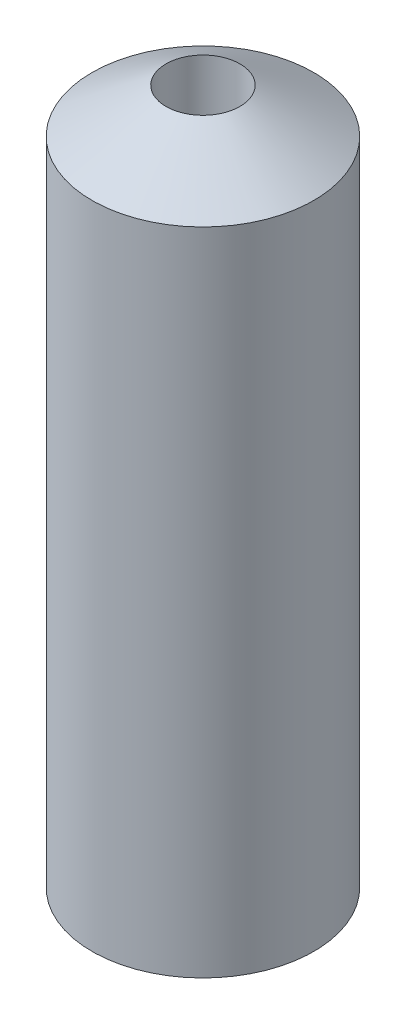
ISO-10303-21;
HEADER;
FILE_DESCRIPTION(('STEP AP214'),'2;1');
FILE_NAME('part.step','',(''),(''),'','','');
FILE_SCHEMA(('AUTOMOTIVE_DESIGN { 1 0 10303 214 1 1 1 1 }'));
ENDSEC;
DATA;
#1=APPLICATION_CONTEXT('core data for automotive mechanical design processes');
#2=APPLICATION_PROTOCOL_DEFINITION('international standard','automotive_design',2000,#1);
#3=PRODUCT_CONTEXT('',#1,'mechanical');
#4=PRODUCT('Part','Part','',(#3));
#5=PRODUCT_RELATED_PRODUCT_CATEGORY('part','',(#4));
#6=PRODUCT_DEFINITION_FORMATION('','',#4);
#7=PRODUCT_DEFINITION_CONTEXT('part definition',#1,'design');
#8=PRODUCT_DEFINITION('design','',#6,#7);
#9=PRODUCT_DEFINITION_SHAPE('','',#8);
#10=(LENGTH_UNIT() NAMED_UNIT(*) SI_UNIT(.MILLI.,.METRE.));
#11=(NAMED_UNIT(*) PLANE_ANGLE_UNIT() SI_UNIT($,.RADIAN.));
#12=(NAMED_UNIT(*) SI_UNIT($,.STERADIAN.) SOLID_ANGLE_UNIT());
#13=UNCERTAINTY_MEASURE_WITH_UNIT(LENGTH_MEASURE(1.E-05),#10,'distance_accuracy_value','');
#14=(GEOMETRIC_REPRESENTATION_CONTEXT(3) GLOBAL_UNCERTAINTY_ASSIGNED_CONTEXT((#13)) GLOBAL_UNIT_ASSIGNED_CONTEXT((#10,
#11,#12)) REPRESENTATION_CONTEXT('',''));
#15=CARTESIAN_POINT('',(0.,0.,0.));
#16=DIRECTION('',(0.,0.,1.));
#17=DIRECTION('',(1.,0.,0.));
#18=AXIS2_PLACEMENT_3D('',#15,#16,#17);
#19=CARTESIAN_POINT('',(0.,9.39913938097244,0.));
#20=DIRECTION('',(0.,-1.,0.));
#21=DIRECTION('',(1.,0.,0.));
#22=AXIS2_PLACEMENT_3D('',#19,#20,#21);
#23=CONICAL_SURFACE('',#22,1.5,1.02974425867665);
#24=CARTESIAN_POINT('',(0.,10.,0.));
#25=DIRECTION('',(0.,1.,0.));
#26=DIRECTION('',(-1.,0.,0.));
#27=AXIS2_PLACEMENT_3D('',#24,#25,#26);
#28=CIRCLE('',#27,0.5);
#29=CARTESIAN_POINT('',(-0.5,10.,0.));
#30=VERTEX_POINT('',#29);
#31=EDGE_CURVE('E62',#30,#30,#28,.T.);
#32=ORIENTED_EDGE('',*,*,#31,.F.);
#33=EDGE_LOOP('',(#32));
#34=FACE_BOUND('',#33,.T.);
#35=CARTESIAN_POINT('',(0.,9.39913938097244,0.));
#36=DIRECTION('',(0.,1.,0.));
#37=DIRECTION('',(-1.,0.,0.));
#38=AXIS2_PLACEMENT_3D('',#35,#36,#37);
#39=CIRCLE('',#38,1.5);
#40=CARTESIAN_POINT('',(-1.5,9.39913938097244,0.));
#41=VERTEX_POINT('',#40);
#42=EDGE_CURVE('E10',#41,#41,#39,.T.);
#43=ORIENTED_EDGE('',*,*,#42,.T.);
#44=EDGE_LOOP('',(#43));
#45=FACE_BOUND('',#44,.T.);
#46=ADVANCED_FACE('F45',(#34,#45),#23,.T.);
#47=CARTESIAN_POINT('',(0.,13.298747267043,0.));
#48=DIRECTION('',(0.,1.,0.));
#49=DIRECTION('',(-1.,0.,0.));
#50=AXIS2_PLACEMENT_3D('',#47,#48,#49);
#51=CYLINDRICAL_SURFACE('',#50,1.5);
#52=ORIENTED_EDGE('',*,*,#42,.F.);
#53=EDGE_LOOP('',(#52));
#54=FACE_BOUND('',#53,.T.);
#55=CARTESIAN_POINT('',(0.,0.600860619027567,0.));
#56=DIRECTION('',(0.,1.,0.));
#57=DIRECTION('',(-1.,0.,0.));
#58=AXIS2_PLACEMENT_3D('',#55,#56,#57);
#59=CIRCLE('',#58,1.5);
#60=CARTESIAN_POINT('',(-1.5,0.600860619027567,0.));
#61=VERTEX_POINT('',#60);
#62=EDGE_CURVE('E52',#61,#61,#59,.T.);
#63=ORIENTED_EDGE('',*,*,#62,.T.);
#64=EDGE_LOOP('',(#63));
#65=FACE_BOUND('',#64,.T.);
#66=ADVANCED_FACE('F72',(#54,#65),#51,.T.);
#67=CARTESIAN_POINT('',(0.,0.,0.));
#68=DIRECTION('',(0.,1.,0.));
#69=DIRECTION('',(-1.,0.,0.));
#70=AXIS2_PLACEMENT_3D('',#67,#68,#69);
#71=CONICAL_SURFACE('',#70,0.5,1.02974425867665);
#72=ORIENTED_EDGE('',*,*,#62,.F.);
#73=EDGE_LOOP('',(#72));
#74=FACE_BOUND('',#73,.T.);
#75=CARTESIAN_POINT('',(0.,0.,0.));
#76=DIRECTION('',(0.,1.,0.));
#77=DIRECTION('',(-1.,0.,0.));
#78=AXIS2_PLACEMENT_3D('',#75,#76,#77);
#79=CIRCLE('',#78,0.5);
#80=CARTESIAN_POINT('',(-0.499999999999999,0.,0.));
#81=VERTEX_POINT('',#80);
#82=EDGE_CURVE('E57',#81,#81,#79,.T.);
#83=ORIENTED_EDGE('',*,*,#82,.T.);
#84=EDGE_LOOP('',(#83));
#85=FACE_BOUND('',#84,.T.);
#86=ADVANCED_FACE('F76',(#74,#85),#71,.T.);
#87=CARTESIAN_POINT('',(0.,13.298747267043,0.));
#88=DIRECTION('',(0.,1.,0.));
#89=DIRECTION('',(-1.,0.,0.));
#90=AXIS2_PLACEMENT_3D('',#87,#88,#89);
#91=CYLINDRICAL_SURFACE('',#90,0.5);
#92=ORIENTED_EDGE('',*,*,#82,.F.);
#93=EDGE_LOOP('',(#92));
#94=FACE_BOUND('',#93,.T.);
#95=ORIENTED_EDGE('',*,*,#31,.T.);
#96=EDGE_LOOP('',(#95));
#97=FACE_BOUND('',#96,.T.);
#98=ADVANCED_FACE('F69',(#94,#97),#91,.F.);
#99=CLOSED_SHELL('',(#46,#66,#86,#98));
#100=MANIFOLD_SOLID_BREP('B2',#99);
#101=ADVANCED_BREP_SHAPE_REPRESENTATION('',(#18,#100),#14);
#102=SHAPE_DEFINITION_REPRESENTATION(#9,#101);
ENDSEC;
END-ISO-10303-21;
